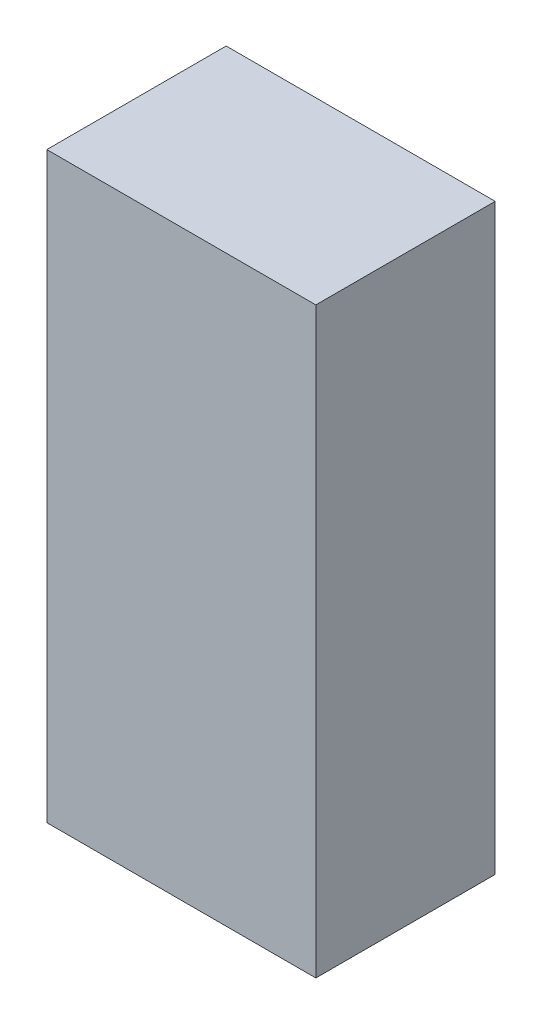
ISO-10303-21;
HEADER;
FILE_DESCRIPTION(('STEP AP214'),'2;1');
FILE_NAME('part.step','',(''),(''),'','','');
FILE_SCHEMA(('AUTOMOTIVE_DESIGN { 1 0 10303 214 1 1 1 1 }'));
ENDSEC;
DATA;
#1=APPLICATION_CONTEXT('core data for automotive mechanical design processes');
#2=APPLICATION_PROTOCOL_DEFINITION('international standard','automotive_design',2000,#1);
#3=PRODUCT_CONTEXT('',#1,'mechanical');
#4=PRODUCT('Part','Part','',(#3));
#5=PRODUCT_RELATED_PRODUCT_CATEGORY('part','',(#4));
#6=PRODUCT_DEFINITION_FORMATION('','',#4);
#7=PRODUCT_DEFINITION_CONTEXT('part definition',#1,'design');
#8=PRODUCT_DEFINITION('design','',#6,#7);
#9=PRODUCT_DEFINITION_SHAPE('','',#8);
#10=(LENGTH_UNIT() NAMED_UNIT(*) SI_UNIT(.MILLI.,.METRE.));
#11=(NAMED_UNIT(*) PLANE_ANGLE_UNIT() SI_UNIT($,.RADIAN.));
#12=(NAMED_UNIT(*) SI_UNIT($,.STERADIAN.) SOLID_ANGLE_UNIT());
#13=UNCERTAINTY_MEASURE_WITH_UNIT(LENGTH_MEASURE(1.E-05),#10,'distance_accuracy_value','');
#14=(GEOMETRIC_REPRESENTATION_CONTEXT(3) GLOBAL_UNCERTAINTY_ASSIGNED_CONTEXT((#13)) GLOBAL_UNIT_ASSIGNED_CONTEXT((#10,
#11,#12)) REPRESENTATION_CONTEXT('',''));
#15=CARTESIAN_POINT('',(0.,0.,0.));
#16=DIRECTION('',(0.,0.,1.));
#17=DIRECTION('',(1.,0.,0.));
#18=AXIS2_PLACEMENT_3D('',#15,#16,#17);
#19=CARTESIAN_POINT('',(-0.2999994,0.65000124,0.4));
#20=DIRECTION('',(0.,0.,1.));
#21=DIRECTION('',(1.,0.,0.));
#22=AXIS2_PLACEMENT_3D('',#19,#20,#21);
#23=PLANE('',#22);
#24=DIRECTION('',(0.,1.,0.));
#25=VECTOR('',#24,1.);
#26=CARTESIAN_POINT('',(0.30000194,0.65000124,0.4));
#27=LINE('',#26,#25);
#28=CARTESIAN_POINT('',(0.30000194,0.65000124,0.4));
#29=VERTEX_POINT('',#28);
#30=CARTESIAN_POINT('',(0.30000194,-0.6499987,0.4));
#31=VERTEX_POINT('',#30);
#32=EDGE_CURVE('E52',#29,#31,#27,.F.);
#33=ORIENTED_EDGE('',*,*,#32,.F.);
#34=DIRECTION('',(1.,0.,0.));
#35=VECTOR('',#34,1.);
#36=CARTESIAN_POINT('',(-0.2999994,0.65000124,0.4));
#37=LINE('',#36,#35);
#38=CARTESIAN_POINT('',(-0.2999994,0.65000124,0.4));
#39=VERTEX_POINT('',#38);
#40=EDGE_CURVE('E67',#39,#29,#37,.T.);
#41=ORIENTED_EDGE('',*,*,#40,.F.);
#42=DIRECTION('',(0.,1.,0.));
#43=VECTOR('',#42,1.);
#44=CARTESIAN_POINT('',(-0.2999994,-0.6499987,0.4));
#45=LINE('',#44,#43);
#46=CARTESIAN_POINT('',(-0.2999994,-0.6499987,0.4));
#47=VERTEX_POINT('',#46);
#48=EDGE_CURVE('E19',#47,#39,#45,.T.);
#49=ORIENTED_EDGE('',*,*,#48,.F.);
#50=DIRECTION('',(1.,0.,0.));
#51=VECTOR('',#50,1.);
#52=CARTESIAN_POINT('',(0.30000194,-0.6499987,0.4));
#53=LINE('',#52,#51);
#54=EDGE_CURVE('E57',#31,#47,#53,.F.);
#55=ORIENTED_EDGE('',*,*,#54,.F.);
#56=EDGE_LOOP('',(#33,#41,#49,#55));
#57=FACE_BOUND('',#56,.T.);
#58=ADVANCED_FACE('F16',(#57),#23,.T.);
#59=CARTESIAN_POINT('',(-0.2999994,-0.6499987,0.));
#60=DIRECTION('',(-1.,0.,0.));
#61=DIRECTION('',(0.,0.,1.));
#62=AXIS2_PLACEMENT_3D('',#59,#60,#61);
#63=PLANE('',#62);
#64=DIRECTION('',(0.,0.,1.));
#65=VECTOR('',#64,1.);
#66=CARTESIAN_POINT('',(-0.2999994,0.65000124,0.));
#67=LINE('',#66,#65);
#68=CARTESIAN_POINT('',(-0.2999994,0.65000124,0.));
#69=VERTEX_POINT('',#68);
#70=EDGE_CURVE('E78',#69,#39,#67,.T.);
#71=ORIENTED_EDGE('',*,*,#70,.F.);
#72=DIRECTION('',(0.,1.,0.));
#73=VECTOR('',#72,1.);
#74=CARTESIAN_POINT('',(-0.2999994,0.65000124,0.));
#75=LINE('',#74,#73);
#76=CARTESIAN_POINT('',(-0.2999994,-0.6499987,0.));
#77=VERTEX_POINT('',#76);
#78=EDGE_CURVE('E73',#69,#77,#75,.F.);
#79=ORIENTED_EDGE('',*,*,#78,.T.);
#80=DIRECTION('',(0.,0.,-1.));
#81=VECTOR('',#80,1.);
#82=CARTESIAN_POINT('',(-0.2999994,-0.6499987,0.));
#83=LINE('',#82,#81);
#84=EDGE_CURVE('E62',#47,#77,#83,.T.);
#85=ORIENTED_EDGE('',*,*,#84,.F.);
#86=ORIENTED_EDGE('',*,*,#48,.T.);
#87=EDGE_LOOP('',(#71,#79,#85,#86));
#88=FACE_BOUND('',#87,.T.);
#89=ADVANCED_FACE('F72',(#88),#63,.T.);
#90=CARTESIAN_POINT('',(0.30000194,-0.6499987,0.));
#91=DIRECTION('',(0.,-1.,0.));
#92=DIRECTION('',(0.,0.,-1.));
#93=AXIS2_PLACEMENT_3D('',#90,#91,#92);
#94=PLANE('',#93);
#95=ORIENTED_EDGE('',*,*,#84,.T.);
#96=DIRECTION('',(1.,0.,0.));
#97=VECTOR('',#96,1.);
#98=CARTESIAN_POINT('',(-0.2999994,-0.6499987,0.));
#99=LINE('',#98,#97);
#100=CARTESIAN_POINT('',(0.30000194,-0.6499987,0.));
#101=VERTEX_POINT('',#100);
#102=EDGE_CURVE('E83',#77,#101,#99,.T.);
#103=ORIENTED_EDGE('',*,*,#102,.T.);
#104=DIRECTION('',(0.,0.,-1.));
#105=VECTOR('',#104,1.);
#106=CARTESIAN_POINT('',(0.30000194,-0.6499987,0.));
#107=LINE('',#106,#105);
#108=EDGE_CURVE('E64',#31,#101,#107,.T.);
#109=ORIENTED_EDGE('',*,*,#108,.F.);
#110=ORIENTED_EDGE('',*,*,#54,.T.);
#111=EDGE_LOOP('',(#95,#103,#109,#110));
#112=FACE_BOUND('',#111,.T.);
#113=ADVANCED_FACE('F59',(#112),#94,.T.);
#114=CARTESIAN_POINT('',(0.30000194,0.65000124,0.));
#115=DIRECTION('',(1.,0.,0.));
#116=DIRECTION('',(0.,0.,-1.));
#117=AXIS2_PLACEMENT_3D('',#114,#115,#116);
#118=PLANE('',#117);
#119=ORIENTED_EDGE('',*,*,#108,.T.);
#120=DIRECTION('',(0.,1.,0.));
#121=VECTOR('',#120,1.);
#122=CARTESIAN_POINT('',(0.30000194,0.65000124,0.));
#123=LINE('',#122,#121);
#124=CARTESIAN_POINT('',(0.30000194,0.65000124,0.));
#125=VERTEX_POINT('',#124);
#126=EDGE_CURVE('E25',#101,#125,#123,.T.);
#127=ORIENTED_EDGE('',*,*,#126,.T.);
#128=DIRECTION('',(0.,0.,1.));
#129=VECTOR('',#128,1.);
#130=CARTESIAN_POINT('',(0.30000194,0.65000124,0.));
#131=LINE('',#130,#129);
#132=EDGE_CURVE('E33',#29,#125,#131,.F.);
#133=ORIENTED_EDGE('',*,*,#132,.F.);
#134=ORIENTED_EDGE('',*,*,#32,.T.);
#135=EDGE_LOOP('',(#119,#127,#133,#134));
#136=FACE_BOUND('',#135,.T.);
#137=ADVANCED_FACE('F87',(#136),#118,.T.);
#138=CARTESIAN_POINT('',(-0.2999994,0.65000124,0.));
#139=DIRECTION('',(0.,1.,0.));
#140=DIRECTION('',(0.,0.,1.));
#141=AXIS2_PLACEMENT_3D('',#138,#139,#140);
#142=PLANE('',#141);
#143=ORIENTED_EDGE('',*,*,#132,.T.);
#144=DIRECTION('',(1.,0.,0.));
#145=VECTOR('',#144,1.);
#146=CARTESIAN_POINT('',(-0.2999994,0.65000124,0.));
#147=LINE('',#146,#145);
#148=EDGE_CURVE('E11',#125,#69,#147,.F.);
#149=ORIENTED_EDGE('',*,*,#148,.T.);
#150=ORIENTED_EDGE('',*,*,#70,.T.);
#151=ORIENTED_EDGE('',*,*,#40,.T.);
#152=EDGE_LOOP('',(#143,#149,#150,#151));
#153=FACE_BOUND('',#152,.T.);
#154=ADVANCED_FACE('F90',(#153),#142,.T.);
#155=CARTESIAN_POINT('',(-0.2999994,0.65000124,0.));
#156=DIRECTION('',(0.,0.,1.));
#157=DIRECTION('',(1.,0.,0.));
#158=AXIS2_PLACEMENT_3D('',#155,#156,#157);
#159=PLANE('',#158);
#160=ORIENTED_EDGE('',*,*,#126,.F.);
#161=ORIENTED_EDGE('',*,*,#102,.F.);
#162=ORIENTED_EDGE('',*,*,#78,.F.);
#163=ORIENTED_EDGE('',*,*,#148,.F.);
#164=EDGE_LOOP('',(#160,#161,#162,#163));
#165=FACE_BOUND('',#164,.T.);
#166=ADVANCED_FACE('F89',(#165),#159,.F.);
#167=CLOSED_SHELL('',(#58,#89,#113,#137,#154,#166));
#168=MANIFOLD_SOLID_BREP('B1',#167);
#169=ADVANCED_BREP_SHAPE_REPRESENTATION('',(#18,#168),#14);
#170=SHAPE_DEFINITION_REPRESENTATION(#9,#169);
ENDSEC;
END-ISO-10303-21;
